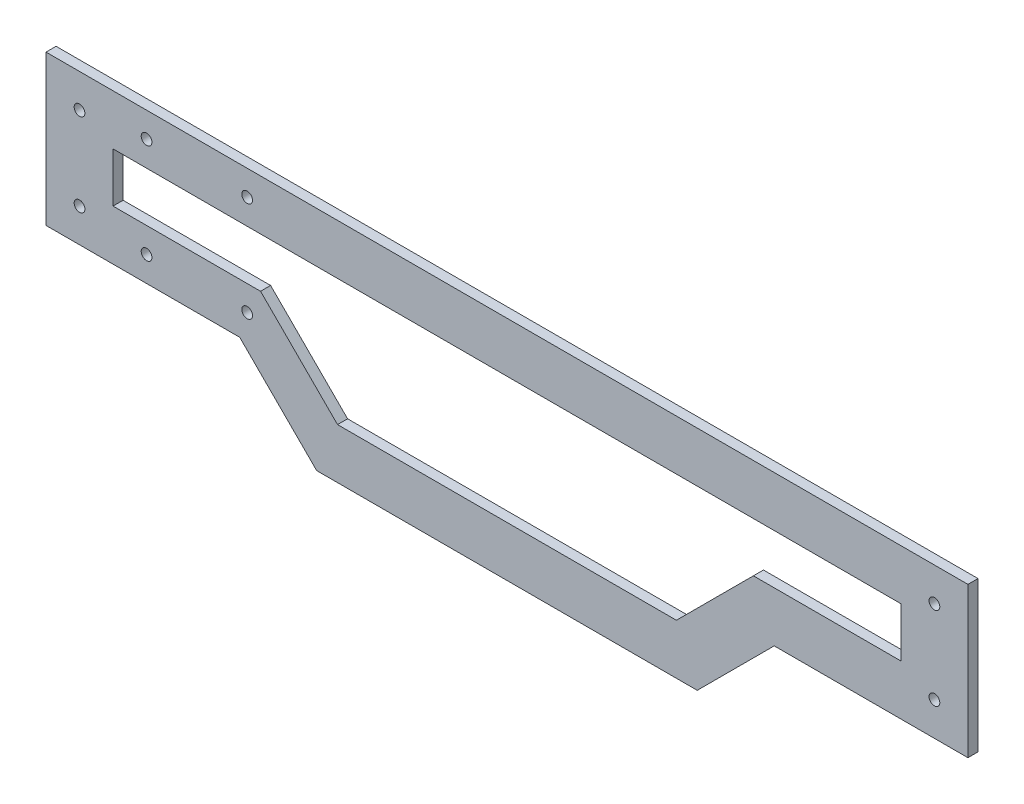
ISO-10303-21;
HEADER;
FILE_DESCRIPTION(('STEP AP214'),'2;1');
FILE_NAME('part.step','',(''),(''),'','','');
FILE_SCHEMA(('AUTOMOTIVE_DESIGN { 1 0 10303 214 1 1 1 1 }'));
ENDSEC;
DATA;
#1=APPLICATION_CONTEXT('core data for automotive mechanical design processes');
#2=APPLICATION_PROTOCOL_DEFINITION('international standard','automotive_design',2000,#1);
#3=PRODUCT_CONTEXT('',#1,'mechanical');
#4=PRODUCT('Part','Part','',(#3));
#5=PRODUCT_RELATED_PRODUCT_CATEGORY('part','',(#4));
#6=PRODUCT_DEFINITION_FORMATION('','',#4);
#7=PRODUCT_DEFINITION_CONTEXT('part definition',#1,'design');
#8=PRODUCT_DEFINITION('design','',#6,#7);
#9=PRODUCT_DEFINITION_SHAPE('','',#8);
#10=(LENGTH_UNIT() NAMED_UNIT(*) SI_UNIT(.MILLI.,.METRE.));
#11=(NAMED_UNIT(*) PLANE_ANGLE_UNIT() SI_UNIT($,.RADIAN.));
#12=(NAMED_UNIT(*) SI_UNIT($,.STERADIAN.) SOLID_ANGLE_UNIT());
#13=UNCERTAINTY_MEASURE_WITH_UNIT(LENGTH_MEASURE(1.E-05),#10,'distance_accuracy_value','');
#14=(GEOMETRIC_REPRESENTATION_CONTEXT(3) GLOBAL_UNCERTAINTY_ASSIGNED_CONTEXT((#13)) GLOBAL_UNIT_ASSIGNED_CONTEXT((#10,
#11,#12)) REPRESENTATION_CONTEXT('',''));
#15=CARTESIAN_POINT('',(0.,0.,0.));
#16=DIRECTION('',(0.,0.,1.));
#17=DIRECTION('',(1.,0.,0.));
#18=AXIS2_PLACEMENT_3D('',#15,#16,#17);
#19=CARTESIAN_POINT('',(0.,0.,3.));
#20=DIRECTION('',(0.,0.,-1.));
#21=DIRECTION('',(-1.,0.,0.));
#22=AXIS2_PLACEMENT_3D('',#19,#20,#21);
#23=PLANE('',#22);
#24=CARTESIAN_POINT('',(8.48992123506307,424.784503285472,3.));
#25=DIRECTION('',(0.,0.,-1.));
#26=DIRECTION('',(-1.,0.,0.));
#27=AXIS2_PLACEMENT_3D('',#24,#25,#26);
#28=CIRCLE('',#27,1.6);
#29=CARTESIAN_POINT('',(6.88992123506307,424.784503285472,3.));
#30=VERTEX_POINT('',#29);
#31=EDGE_CURVE('E408',#30,#30,#28,.T.);
#32=ORIENTED_EDGE('',*,*,#31,.T.);
#33=EDGE_LOOP('',(#32));
#34=FACE_BOUND('',#33,.T.);
#35=CARTESIAN_POINT('',(38.4899212350631,394.997048213572,3.));
#36=DIRECTION('',(0.,0.,-1.));
#37=DIRECTION('',(-1.,0.,0.));
#38=AXIS2_PLACEMENT_3D('',#35,#36,#37);
#39=CIRCLE('',#38,1.6);
#40=CARTESIAN_POINT('',(36.8899212350631,394.997048213572,3.));
#41=VERTEX_POINT('',#40);
#42=EDGE_CURVE('E404',#41,#41,#39,.T.);
#43=ORIENTED_EDGE('',*,*,#42,.T.);
#44=EDGE_LOOP('',(#43));
#45=FACE_BOUND('',#44,.T.);
#46=CARTESIAN_POINT('',(8.48992123506307,394.997048213572,3.));
#47=DIRECTION('',(0.,0.,-1.));
#48=DIRECTION('',(-1.,0.,0.));
#49=AXIS2_PLACEMENT_3D('',#46,#47,#48);
#50=CIRCLE('',#49,1.6);
#51=CARTESIAN_POINT('',(6.88992123506307,394.997048213572,3.));
#52=VERTEX_POINT('',#51);
#53=EDGE_CURVE('E402',#52,#52,#50,.T.);
#54=ORIENTED_EDGE('',*,*,#53,.T.);
#55=EDGE_LOOP('',(#54));
#56=FACE_BOUND('',#55,.T.);
#57=CARTESIAN_POINT('',(38.4899212350631,424.784503285472,3.));
#58=DIRECTION('',(0.,0.,-1.));
#59=DIRECTION('',(-1.,0.,0.));
#60=AXIS2_PLACEMENT_3D('',#57,#58,#59);
#61=CIRCLE('',#60,1.6);
#62=CARTESIAN_POINT('',(36.8899212350631,424.784503285472,3.));
#63=VERTEX_POINT('',#62);
#64=EDGE_CURVE('E405',#63,#63,#61,.T.);
#65=ORIENTED_EDGE('',*,*,#64,.T.);
#66=EDGE_LOOP('',(#65));
#67=FACE_BOUND('',#66,.T.);
#68=DIRECTION('',(0.,-1.,0.));
#69=VECTOR('',#68,1.);
#70=CARTESIAN_POINT('',(-21.5100787649369,387.497048213572,3.));
#71=LINE('',#70,#69);
#72=CARTESIAN_POINT('',(-21.5100787649369,432.284503285472,3.));
#73=VERTEX_POINT('',#72);
#74=CARTESIAN_POINT('',(-21.5100787649369,387.497048213572,3.));
#75=VERTEX_POINT('',#74);
#76=EDGE_CURVE('E216',#73,#75,#71,.T.);
#77=ORIENTED_EDGE('',*,*,#76,.T.);
#78=DIRECTION('',(1.,0.,0.));
#79=VECTOR('',#78,1.);
#80=CARTESIAN_POINT('',(36.2716671655838,387.497048213572,3.));
#81=LINE('',#80,#79);
#82=CARTESIAN_POINT('',(36.2716671655838,387.497048213572,3.));
#83=VERTEX_POINT('',#82);
#84=EDGE_CURVE('E219',#75,#83,#81,.T.);
#85=ORIENTED_EDGE('',*,*,#84,.T.);
#86=DIRECTION('',(0.707106781186548,-0.707106781186547,0.));
#87=VECTOR('',#86,1.);
#88=CARTESIAN_POINT('',(59.2342475847707,364.534467794385,3.));
#89=LINE('',#88,#87);
#90=CARTESIAN_POINT('',(59.2342475847707,364.534467794385,3.));
#91=VERTEX_POINT('',#90);
#92=EDGE_CURVE('E222',#83,#91,#89,.T.);
#93=ORIENTED_EDGE('',*,*,#92,.T.);
#94=DIRECTION('',(1.,0.,0.));
#95=VECTOR('',#94,1.);
#96=CARTESIAN_POINT('',(172.745594885355,364.534467794385,3.));
#97=LINE('',#96,#95);
#98=CARTESIAN_POINT('',(172.745594885355,364.534467794385,3.));
#99=VERTEX_POINT('',#98);
#100=EDGE_CURVE('E224',#91,#99,#97,.T.);
#101=ORIENTED_EDGE('',*,*,#100,.T.);
#102=DIRECTION('',(0.707106781186547,0.707106781186547,0.));
#103=VECTOR('',#102,1.);
#104=CARTESIAN_POINT('',(195.708175304542,387.497048213572,3.));
#105=LINE('',#104,#103);
#106=CARTESIAN_POINT('',(195.708175304542,387.497048213572,3.));
#107=VERTEX_POINT('',#106);
#108=EDGE_CURVE('E226',#99,#107,#105,.T.);
#109=ORIENTED_EDGE('',*,*,#108,.T.);
#110=DIRECTION('',(1.,0.,0.));
#111=VECTOR('',#110,1.);
#112=CARTESIAN_POINT('',(253.489921235063,387.497048213572,3.));
#113=LINE('',#112,#111);
#114=CARTESIAN_POINT('',(253.489921235063,387.497048213572,3.));
#115=VERTEX_POINT('',#114);
#116=EDGE_CURVE('E228',#107,#115,#113,.T.);
#117=ORIENTED_EDGE('',*,*,#116,.T.);
#118=DIRECTION('',(0.,1.,0.));
#119=VECTOR('',#118,1.);
#120=CARTESIAN_POINT('',(253.489921235063,432.284503285472,3.));
#121=LINE('',#120,#119);
#122=CARTESIAN_POINT('',(253.489921235063,432.284503285472,3.));
#123=VERTEX_POINT('',#122);
#124=EDGE_CURVE('E230',#115,#123,#121,.T.);
#125=ORIENTED_EDGE('',*,*,#124,.T.);
#126=DIRECTION('',(-1.,0.,0.));
#127=VECTOR('',#126,1.);
#128=CARTESIAN_POINT('',(-21.5100787649369,432.284503285472,3.));
#129=LINE('',#128,#127);
#130=EDGE_CURVE('E232',#123,#73,#129,.T.);
#131=ORIENTED_EDGE('',*,*,#130,.T.);
#132=EDGE_LOOP('',(#77,#85,#93,#101,#109,#117,#125,#131));
#133=FACE_BOUND('',#132,.T.);
#134=DIRECTION('',(0.,-1.,0.));
#135=VECTOR('',#134,1.);
#136=CARTESIAN_POINT('',(-1.51007876493693,402.497048213572,3.));
#137=LINE('',#136,#135);
#138=CARTESIAN_POINT('',(-1.51007876493693,417.284503285472,3.));
#139=VERTEX_POINT('',#138);
#140=CARTESIAN_POINT('',(-1.51007876493693,402.497048213572,3.));
#141=VERTEX_POINT('',#140);
#142=EDGE_CURVE('E148',#139,#141,#137,.T.);
#143=ORIENTED_EDGE('',*,*,#142,.F.);
#144=DIRECTION('',(-1.,0.,0.));
#145=VECTOR('',#144,1.);
#146=CARTESIAN_POINT('',(-1.51007876493693,417.284503285472,3.));
#147=LINE('',#146,#145);
#148=CARTESIAN_POINT('',(233.489921235063,417.284503285472,3.));
#149=VERTEX_POINT('',#148);
#150=EDGE_CURVE('E183',#149,#139,#147,.T.);
#151=ORIENTED_EDGE('',*,*,#150,.F.);
#152=DIRECTION('',(0.,1.,0.));
#153=VECTOR('',#152,1.);
#154=CARTESIAN_POINT('',(233.489921235063,417.284503285472,3.));
#155=LINE('',#154,#153);
#156=CARTESIAN_POINT('',(233.489921235063,402.497048213572,3.));
#157=VERTEX_POINT('',#156);
#158=EDGE_CURVE('E181',#157,#149,#155,.T.);
#159=ORIENTED_EDGE('',*,*,#158,.F.);
#160=DIRECTION('',(1.,0.,0.));
#161=VECTOR('',#160,1.);
#162=CARTESIAN_POINT('',(233.489921235063,402.497048213572,3.));
#163=LINE('',#162,#161);
#164=CARTESIAN_POINT('',(189.494971868946,402.497048213572,3.));
#165=VERTEX_POINT('',#164);
#166=EDGE_CURVE('E179',#165,#157,#163,.T.);
#167=ORIENTED_EDGE('',*,*,#166,.F.);
#168=DIRECTION('',(0.707106781186547,0.707106781186548,0.));
#169=VECTOR('',#168,1.);
#170=CARTESIAN_POINT('',(189.494971868946,402.497048213572,3.));
#171=LINE('',#170,#169);
#172=CARTESIAN_POINT('',(166.532391449759,379.534467794385,3.));
#173=VERTEX_POINT('',#172);
#174=EDGE_CURVE('E177',#173,#165,#171,.T.);
#175=ORIENTED_EDGE('',*,*,#174,.F.);
#176=DIRECTION('',(1.,0.,0.));
#177=VECTOR('',#176,1.);
#178=CARTESIAN_POINT('',(166.532391449759,379.534467794385,3.));
#179=LINE('',#178,#177);
#180=CARTESIAN_POINT('',(65.4474510203671,379.534467794385,3.));
#181=VERTEX_POINT('',#180);
#182=EDGE_CURVE('E172',#181,#173,#179,.T.);
#183=ORIENTED_EDGE('',*,*,#182,.F.);
#184=DIRECTION('',(0.707106781186548,-0.707106781186547,0.));
#185=VECTOR('',#184,1.);
#186=CARTESIAN_POINT('',(65.4474510203671,379.534467794385,3.));
#187=LINE('',#186,#185);
#188=CARTESIAN_POINT('',(42.4848706011802,402.497048213572,3.));
#189=VERTEX_POINT('',#188);
#190=EDGE_CURVE('E170',#189,#181,#187,.T.);
#191=ORIENTED_EDGE('',*,*,#190,.F.);
#192=DIRECTION('',(1.,0.,0.));
#193=VECTOR('',#192,1.);
#194=CARTESIAN_POINT('',(42.4848706011802,402.497048213572,3.));
#195=LINE('',#194,#193);
#196=EDGE_CURVE('E156',#141,#189,#195,.T.);
#197=ORIENTED_EDGE('',*,*,#196,.F.);
#198=EDGE_LOOP('',(#143,#151,#159,#167,#175,#183,#191,#197));
#199=FACE_BOUND('',#198,.T.);
#200=CARTESIAN_POINT('',(-11.5100787649369,422.284503285472,3.));
#201=DIRECTION('',(0.,0.,1.));
#202=DIRECTION('',(1.,0.,0.));
#203=AXIS2_PLACEMENT_3D('',#200,#201,#202);
#204=CIRCLE('',#203,1.6);
#205=CARTESIAN_POINT('',(-9.91007876493693,422.284503285472,3.));
#206=VERTEX_POINT('',#205);
#207=EDGE_CURVE('E186',#206,#206,#204,.T.);
#208=ORIENTED_EDGE('',*,*,#207,.F.);
#209=EDGE_LOOP('',(#208));
#210=FACE_BOUND('',#209,.T.);
#211=CARTESIAN_POINT('',(-11.5100787649369,397.497048213572,3.));
#212=DIRECTION('',(0.,0.,1.));
#213=DIRECTION('',(1.,0.,0.));
#214=AXIS2_PLACEMENT_3D('',#211,#212,#213);
#215=CIRCLE('',#214,1.6);
#216=CARTESIAN_POINT('',(-9.91007876493693,397.497048213572,3.));
#217=VERTEX_POINT('',#216);
#218=EDGE_CURVE('E429',#217,#217,#215,.T.);
#219=ORIENTED_EDGE('',*,*,#218,.F.);
#220=EDGE_LOOP('',(#219));
#221=FACE_BOUND('',#220,.T.);
#222=CARTESIAN_POINT('',(243.489921235063,397.497048213572,3.));
#223=DIRECTION('',(0.,0.,1.));
#224=DIRECTION('',(-1.,0.,0.));
#225=AXIS2_PLACEMENT_3D('',#222,#223,#224);
#226=CIRCLE('',#225,1.59999999999999);
#227=CARTESIAN_POINT('',(241.889921235063,397.497048213572,3.));
#228=VERTEX_POINT('',#227);
#229=EDGE_CURVE('E423',#228,#228,#226,.T.);
#230=ORIENTED_EDGE('',*,*,#229,.F.);
#231=EDGE_LOOP('',(#230));
#232=FACE_BOUND('',#231,.T.);
#233=CARTESIAN_POINT('',(243.489921235063,422.284503285471,3.));
#234=DIRECTION('',(0.,0.,1.));
#235=DIRECTION('',(-1.,0.,0.));
#236=AXIS2_PLACEMENT_3D('',#233,#234,#235);
#237=CIRCLE('',#236,1.59999999999999);
#238=CARTESIAN_POINT('',(241.889921235063,422.284503285471,3.));
#239=VERTEX_POINT('',#238);
#240=EDGE_CURVE('E417',#239,#239,#237,.T.);
#241=ORIENTED_EDGE('',*,*,#240,.F.);
#242=EDGE_LOOP('',(#241));
#243=FACE_BOUND('',#242,.T.);
#244=ADVANCED_FACE('F35',(#34,#45,#56,#67,#133,#199,#210,#221,#232,#243),#23,.F.);
#245=CARTESIAN_POINT('',(0.,0.,0.));
#246=DIRECTION('',(0.,0.,-1.));
#247=DIRECTION('',(-1.,0.,0.));
#248=AXIS2_PLACEMENT_3D('',#245,#246,#247);
#249=PLANE('',#248);
#250=CARTESIAN_POINT('',(8.48992123506307,424.784503285472,0.));
#251=DIRECTION('',(0.,0.,-1.));
#252=DIRECTION('',(-1.,0.,0.));
#253=AXIS2_PLACEMENT_3D('',#250,#251,#252);
#254=CIRCLE('',#253,1.6);
#255=CARTESIAN_POINT('',(6.88992123506307,424.784503285472,0.));
#256=VERTEX_POINT('',#255);
#257=EDGE_CURVE('E460',#256,#256,#254,.T.);
#258=ORIENTED_EDGE('',*,*,#257,.F.);
#259=EDGE_LOOP('',(#258));
#260=FACE_BOUND('',#259,.T.);
#261=CARTESIAN_POINT('',(38.4899212350631,394.997048213572,0.));
#262=DIRECTION('',(0.,0.,-1.));
#263=DIRECTION('',(-1.,0.,0.));
#264=AXIS2_PLACEMENT_3D('',#261,#262,#263);
#265=CIRCLE('',#264,1.6);
#266=CARTESIAN_POINT('',(36.8899212350631,394.997048213572,0.));
#267=VERTEX_POINT('',#266);
#268=EDGE_CURVE('E461',#267,#267,#265,.T.);
#269=ORIENTED_EDGE('',*,*,#268,.F.);
#270=EDGE_LOOP('',(#269));
#271=FACE_BOUND('',#270,.T.);
#272=CARTESIAN_POINT('',(8.48992123506307,394.997048213572,0.));
#273=DIRECTION('',(0.,0.,-1.));
#274=DIRECTION('',(-1.,0.,0.));
#275=AXIS2_PLACEMENT_3D('',#272,#273,#274);
#276=CIRCLE('',#275,1.6);
#277=CARTESIAN_POINT('',(6.88992123506307,394.997048213572,0.));
#278=VERTEX_POINT('',#277);
#279=EDGE_CURVE('E399',#278,#278,#276,.T.);
#280=ORIENTED_EDGE('',*,*,#279,.F.);
#281=EDGE_LOOP('',(#280));
#282=FACE_BOUND('',#281,.T.);
#283=CARTESIAN_POINT('',(38.4899212350631,424.784503285472,0.));
#284=DIRECTION('',(0.,0.,-1.));
#285=DIRECTION('',(-1.,0.,0.));
#286=AXIS2_PLACEMENT_3D('',#283,#284,#285);
#287=CIRCLE('',#286,1.6);
#288=CARTESIAN_POINT('',(36.8899212350631,424.784503285472,0.));
#289=VERTEX_POINT('',#288);
#290=EDGE_CURVE('E411',#289,#289,#287,.T.);
#291=ORIENTED_EDGE('',*,*,#290,.F.);
#292=EDGE_LOOP('',(#291));
#293=FACE_BOUND('',#292,.T.);
#294=CARTESIAN_POINT('',(243.489921235063,397.497048213572,0.));
#295=DIRECTION('',(0.,0.,1.));
#296=DIRECTION('',(-1.,0.,0.));
#297=AXIS2_PLACEMENT_3D('',#294,#295,#296);
#298=CIRCLE('',#297,1.59999999999999);
#299=CARTESIAN_POINT('',(241.889921235063,397.497048213572,0.));
#300=VERTEX_POINT('',#299);
#301=EDGE_CURVE('E420',#300,#300,#298,.T.);
#302=ORIENTED_EDGE('',*,*,#301,.T.);
#303=EDGE_LOOP('',(#302));
#304=FACE_BOUND('',#303,.T.);
#305=CARTESIAN_POINT('',(-11.5100787649369,422.284503285472,0.));
#306=DIRECTION('',(0.,0.,1.));
#307=DIRECTION('',(1.,0.,0.));
#308=AXIS2_PLACEMENT_3D('',#305,#306,#307);
#309=CIRCLE('',#308,1.6);
#310=CARTESIAN_POINT('',(-9.91007876493693,422.284503285472,0.));
#311=VERTEX_POINT('',#310);
#312=EDGE_CURVE('E432',#311,#311,#309,.T.);
#313=ORIENTED_EDGE('',*,*,#312,.T.);
#314=EDGE_LOOP('',(#313));
#315=FACE_BOUND('',#314,.T.);
#316=DIRECTION('',(0.,-1.,0.));
#317=VECTOR('',#316,1.);
#318=CARTESIAN_POINT('',(-21.5100787649369,387.497048213572,0.));
#319=LINE('',#318,#317);
#320=CARTESIAN_POINT('',(-21.5100787649369,432.284503285472,0.));
#321=VERTEX_POINT('',#320);
#322=CARTESIAN_POINT('',(-21.5100787649369,387.497048213572,0.));
#323=VERTEX_POINT('',#322);
#324=EDGE_CURVE('E164',#321,#323,#319,.T.);
#325=ORIENTED_EDGE('',*,*,#324,.F.);
#326=DIRECTION('',(-1.,0.,0.));
#327=VECTOR('',#326,1.);
#328=CARTESIAN_POINT('',(-21.5100787649369,432.284503285472,0.));
#329=LINE('',#328,#327);
#330=CARTESIAN_POINT('',(253.489921235063,432.284503285472,0.));
#331=VERTEX_POINT('',#330);
#332=EDGE_CURVE('E220',#331,#321,#329,.T.);
#333=ORIENTED_EDGE('',*,*,#332,.F.);
#334=DIRECTION('',(0.,1.,0.));
#335=VECTOR('',#334,1.);
#336=CARTESIAN_POINT('',(253.489921235063,432.284503285472,0.));
#337=LINE('',#336,#335);
#338=CARTESIAN_POINT('',(253.489921235063,387.497048213572,0.));
#339=VERTEX_POINT('',#338);
#340=EDGE_CURVE('E247',#339,#331,#337,.T.);
#341=ORIENTED_EDGE('',*,*,#340,.F.);
#342=DIRECTION('',(1.,0.,0.));
#343=VECTOR('',#342,1.);
#344=CARTESIAN_POINT('',(253.489921235063,387.497048213572,0.));
#345=LINE('',#344,#343);
#346=CARTESIAN_POINT('',(195.708175304542,387.497048213572,0.));
#347=VERTEX_POINT('',#346);
#348=EDGE_CURVE('E245',#347,#339,#345,.T.);
#349=ORIENTED_EDGE('',*,*,#348,.F.);
#350=DIRECTION('',(0.707106781186547,0.707106781186547,0.));
#351=VECTOR('',#350,1.);
#352=CARTESIAN_POINT('',(195.708175304542,387.497048213572,0.));
#353=LINE('',#352,#351);
#354=CARTESIAN_POINT('',(172.745594885355,364.534467794385,0.));
#355=VERTEX_POINT('',#354);
#356=EDGE_CURVE('E243',#355,#347,#353,.T.);
#357=ORIENTED_EDGE('',*,*,#356,.F.);
#358=DIRECTION('',(1.,0.,0.));
#359=VECTOR('',#358,1.);
#360=CARTESIAN_POINT('',(172.745594885355,364.534467794385,0.));
#361=LINE('',#360,#359);
#362=CARTESIAN_POINT('',(59.2342475847707,364.534467794385,0.));
#363=VERTEX_POINT('',#362);
#364=EDGE_CURVE('E241',#363,#355,#361,.T.);
#365=ORIENTED_EDGE('',*,*,#364,.F.);
#366=DIRECTION('',(0.707106781186548,-0.707106781186547,0.));
#367=VECTOR('',#366,1.);
#368=CARTESIAN_POINT('',(59.2342475847707,364.534467794385,0.));
#369=LINE('',#368,#367);
#370=CARTESIAN_POINT('',(36.2716671655838,387.497048213572,0.));
#371=VERTEX_POINT('',#370);
#372=EDGE_CURVE('E239',#371,#363,#369,.T.);
#373=ORIENTED_EDGE('',*,*,#372,.F.);
#374=DIRECTION('',(1.,0.,0.));
#375=VECTOR('',#374,1.);
#376=CARTESIAN_POINT('',(36.2716671655838,387.497048213572,0.));
#377=LINE('',#376,#375);
#378=EDGE_CURVE('E237',#323,#371,#377,.T.);
#379=ORIENTED_EDGE('',*,*,#378,.F.);
#380=EDGE_LOOP('',(#325,#333,#341,#349,#357,#365,#373,#379));
#381=FACE_BOUND('',#380,.T.);
#382=DIRECTION('',(-1.,0.,0.));
#383=VECTOR('',#382,1.);
#384=CARTESIAN_POINT('',(-1.51007876493693,417.284503285472,0.));
#385=LINE('',#384,#383);
#386=CARTESIAN_POINT('',(233.489921235063,417.284503285472,0.));
#387=VERTEX_POINT('',#386);
#388=CARTESIAN_POINT('',(-1.51007876493693,417.284503285472,0.));
#389=VERTEX_POINT('',#388);
#390=EDGE_CURVE('E157',#387,#389,#385,.T.);
#391=ORIENTED_EDGE('',*,*,#390,.T.);
#392=DIRECTION('',(0.,-1.,0.));
#393=VECTOR('',#392,1.);
#394=CARTESIAN_POINT('',(-1.51007876493693,402.497048213572,0.));
#395=LINE('',#394,#393);
#396=CARTESIAN_POINT('',(-1.51007876493693,402.497048213572,0.));
#397=VERTEX_POINT('',#396);
#398=EDGE_CURVE('E58',#389,#397,#395,.T.);
#399=ORIENTED_EDGE('',*,*,#398,.T.);
#400=DIRECTION('',(1.,0.,0.));
#401=VECTOR('',#400,1.);
#402=CARTESIAN_POINT('',(42.4848706011802,402.497048213572,0.));
#403=LINE('',#402,#401);
#404=CARTESIAN_POINT('',(42.4848706011802,402.497048213572,0.));
#405=VERTEX_POINT('',#404);
#406=EDGE_CURVE('E163',#397,#405,#403,.T.);
#407=ORIENTED_EDGE('',*,*,#406,.T.);
#408=DIRECTION('',(0.707106781186548,-0.707106781186547,0.));
#409=VECTOR('',#408,1.);
#410=CARTESIAN_POINT('',(65.4474510203671,379.534467794385,0.));
#411=LINE('',#410,#409);
#412=CARTESIAN_POINT('',(65.4474510203671,379.534467794385,0.));
#413=VERTEX_POINT('',#412);
#414=EDGE_CURVE('E188',#405,#413,#411,.T.);
#415=ORIENTED_EDGE('',*,*,#414,.T.);
#416=DIRECTION('',(1.,0.,0.));
#417=VECTOR('',#416,1.);
#418=CARTESIAN_POINT('',(166.532391449759,379.534467794385,0.));
#419=LINE('',#418,#417);
#420=CARTESIAN_POINT('',(166.532391449759,379.534467794385,0.));
#421=VERTEX_POINT('',#420);
#422=EDGE_CURVE('E191',#413,#421,#419,.T.);
#423=ORIENTED_EDGE('',*,*,#422,.T.);
#424=DIRECTION('',(0.707106781186547,0.707106781186548,0.));
#425=VECTOR('',#424,1.);
#426=CARTESIAN_POINT('',(189.494971868946,402.497048213572,0.));
#427=LINE('',#426,#425);
#428=CARTESIAN_POINT('',(189.494971868946,402.497048213572,0.));
#429=VERTEX_POINT('',#428);
#430=EDGE_CURVE('E194',#421,#429,#427,.T.);
#431=ORIENTED_EDGE('',*,*,#430,.T.);
#432=DIRECTION('',(1.,0.,0.));
#433=VECTOR('',#432,1.);
#434=CARTESIAN_POINT('',(233.489921235063,402.497048213572,0.));
#435=LINE('',#434,#433);
#436=CARTESIAN_POINT('',(233.489921235063,402.497048213572,0.));
#437=VERTEX_POINT('',#436);
#438=EDGE_CURVE('E197',#429,#437,#435,.T.);
#439=ORIENTED_EDGE('',*,*,#438,.T.);
#440=DIRECTION('',(0.,1.,0.));
#441=VECTOR('',#440,1.);
#442=CARTESIAN_POINT('',(233.489921235063,417.284503285472,0.));
#443=LINE('',#442,#441);
#444=EDGE_CURVE('E200',#437,#387,#443,.T.);
#445=ORIENTED_EDGE('',*,*,#444,.T.);
#446=EDGE_LOOP('',(#391,#399,#407,#415,#423,#431,#439,#445));
#447=FACE_BOUND('',#446,.T.);
#448=CARTESIAN_POINT('',(-11.5100787649369,397.497048213572,0.));
#449=DIRECTION('',(0.,0.,1.));
#450=DIRECTION('',(1.,0.,0.));
#451=AXIS2_PLACEMENT_3D('',#448,#449,#450);
#452=CIRCLE('',#451,1.6);
#453=CARTESIAN_POINT('',(-9.91007876493693,397.497048213572,0.));
#454=VERTEX_POINT('',#453);
#455=EDGE_CURVE('E426',#454,#454,#452,.T.);
#456=ORIENTED_EDGE('',*,*,#455,.T.);
#457=EDGE_LOOP('',(#456));
#458=FACE_BOUND('',#457,.T.);
#459=CARTESIAN_POINT('',(243.489921235063,422.284503285471,0.));
#460=DIRECTION('',(0.,0.,1.));
#461=DIRECTION('',(-1.,0.,0.));
#462=AXIS2_PLACEMENT_3D('',#459,#460,#461);
#463=CIRCLE('',#462,1.59999999999999);
#464=CARTESIAN_POINT('',(241.889921235063,422.284503285471,0.));
#465=VERTEX_POINT('',#464);
#466=EDGE_CURVE('E416',#465,#465,#463,.T.);
#467=ORIENTED_EDGE('',*,*,#466,.T.);
#468=EDGE_LOOP('',(#467));
#469=FACE_BOUND('',#468,.T.);
#470=ADVANCED_FACE('F277',(#260,#271,#282,#293,#304,#315,#381,#447,#458,#469),#249,.T.);
#471=CARTESIAN_POINT('',(-21.5100787649369,387.497048213572,3.));
#472=DIRECTION('',(1.,0.,0.));
#473=DIRECTION('',(0.,0.,-1.));
#474=AXIS2_PLACEMENT_3D('',#471,#472,#473);
#475=PLANE('',#474);
#476=ORIENTED_EDGE('',*,*,#324,.T.);
#477=DIRECTION('',(0.,0.,-1.));
#478=VECTOR('',#477,1.);
#479=CARTESIAN_POINT('',(-21.5100787649369,387.497048213572,3.));
#480=LINE('',#479,#478);
#481=EDGE_CURVE('E11',#75,#323,#480,.T.);
#482=ORIENTED_EDGE('',*,*,#481,.F.);
#483=ORIENTED_EDGE('',*,*,#76,.F.);
#484=DIRECTION('',(0.,0.,-1.));
#485=VECTOR('',#484,1.);
#486=CARTESIAN_POINT('',(-21.5100787649369,432.284503285472,3.));
#487=LINE('',#486,#485);
#488=EDGE_CURVE('E234',#73,#321,#487,.T.);
#489=ORIENTED_EDGE('',*,*,#488,.T.);
#490=EDGE_LOOP('',(#476,#482,#483,#489));
#491=FACE_BOUND('',#490,.T.);
#492=ADVANCED_FACE('F37',(#491),#475,.F.);
#493=CARTESIAN_POINT('',(36.2716671655838,387.497048213572,3.));
#494=DIRECTION('',(0.,1.,0.));
#495=DIRECTION('',(0.,0.,1.));
#496=AXIS2_PLACEMENT_3D('',#493,#494,#495);
#497=PLANE('',#496);
#498=ORIENTED_EDGE('',*,*,#378,.T.);
#499=DIRECTION('',(0.,0.,-1.));
#500=VECTOR('',#499,1.);
#501=CARTESIAN_POINT('',(36.2716671655838,387.497048213572,3.));
#502=LINE('',#501,#500);
#503=EDGE_CURVE('E43',#83,#371,#502,.T.);
#504=ORIENTED_EDGE('',*,*,#503,.F.);
#505=ORIENTED_EDGE('',*,*,#84,.F.);
#506=ORIENTED_EDGE('',*,*,#481,.T.);
#507=EDGE_LOOP('',(#498,#504,#505,#506));
#508=FACE_BOUND('',#507,.T.);
#509=ADVANCED_FACE('F294',(#508),#497,.F.);
#510=CARTESIAN_POINT('',(59.2342475847707,364.534467794385,3.));
#511=DIRECTION('',(0.707106781186547,0.707106781186548,0.));
#512=DIRECTION('',(-0.707106781186548,0.707106781186547,0.));
#513=AXIS2_PLACEMENT_3D('',#510,#511,#512);
#514=PLANE('',#513);
#515=ORIENTED_EDGE('',*,*,#372,.T.);
#516=DIRECTION('',(0.,0.,-1.));
#517=VECTOR('',#516,1.);
#518=CARTESIAN_POINT('',(59.2342475847707,364.534467794385,3.));
#519=LINE('',#518,#517);
#520=EDGE_CURVE('E264',#91,#363,#519,.T.);
#521=ORIENTED_EDGE('',*,*,#520,.F.);
#522=ORIENTED_EDGE('',*,*,#92,.F.);
#523=ORIENTED_EDGE('',*,*,#503,.T.);
#524=EDGE_LOOP('',(#515,#521,#522,#523));
#525=FACE_BOUND('',#524,.T.);
#526=ADVANCED_FACE('F271',(#525),#514,.F.);
#527=CARTESIAN_POINT('',(172.745594885355,364.534467794385,3.));
#528=DIRECTION('',(0.,1.,0.));
#529=DIRECTION('',(0.,0.,1.));
#530=AXIS2_PLACEMENT_3D('',#527,#528,#529);
#531=PLANE('',#530);
#532=ORIENTED_EDGE('',*,*,#364,.T.);
#533=DIRECTION('',(0.,0.,-1.));
#534=VECTOR('',#533,1.);
#535=CARTESIAN_POINT('',(172.745594885355,364.534467794385,3.));
#536=LINE('',#535,#534);
#537=EDGE_CURVE('E261',#99,#355,#536,.T.);
#538=ORIENTED_EDGE('',*,*,#537,.F.);
#539=ORIENTED_EDGE('',*,*,#100,.F.);
#540=ORIENTED_EDGE('',*,*,#520,.T.);
#541=EDGE_LOOP('',(#532,#538,#539,#540));
#542=FACE_BOUND('',#541,.T.);
#543=ADVANCED_FACE('F283',(#542),#531,.F.);
#544=CARTESIAN_POINT('',(195.708175304542,387.497048213572,3.));
#545=DIRECTION('',(-0.707106781186548,0.707106781186548,0.));
#546=DIRECTION('',(-0.707106781186548,-0.707106781186548,0.));
#547=AXIS2_PLACEMENT_3D('',#544,#545,#546);
#548=PLANE('',#547);
#549=ORIENTED_EDGE('',*,*,#356,.T.);
#550=DIRECTION('',(0.,0.,-1.));
#551=VECTOR('',#550,1.);
#552=CARTESIAN_POINT('',(195.708175304542,387.497048213572,3.));
#553=LINE('',#552,#551);
#554=EDGE_CURVE('E258',#107,#347,#553,.T.);
#555=ORIENTED_EDGE('',*,*,#554,.F.);
#556=ORIENTED_EDGE('',*,*,#108,.F.);
#557=ORIENTED_EDGE('',*,*,#537,.T.);
#558=EDGE_LOOP('',(#549,#555,#556,#557));
#559=FACE_BOUND('',#558,.T.);
#560=ADVANCED_FACE('F287',(#559),#548,.F.);
#561=CARTESIAN_POINT('',(253.489921235063,387.497048213572,3.));
#562=DIRECTION('',(0.,1.,0.));
#563=DIRECTION('',(0.,0.,1.));
#564=AXIS2_PLACEMENT_3D('',#561,#562,#563);
#565=PLANE('',#564);
#566=ORIENTED_EDGE('',*,*,#348,.T.);
#567=DIRECTION('',(0.,0.,-1.));
#568=VECTOR('',#567,1.);
#569=CARTESIAN_POINT('',(253.489921235063,387.497048213572,3.));
#570=LINE('',#569,#568);
#571=EDGE_CURVE('E255',#115,#339,#570,.T.);
#572=ORIENTED_EDGE('',*,*,#571,.F.);
#573=ORIENTED_EDGE('',*,*,#116,.F.);
#574=ORIENTED_EDGE('',*,*,#554,.T.);
#575=EDGE_LOOP('',(#566,#572,#573,#574));
#576=FACE_BOUND('',#575,.T.);
#577=ADVANCED_FACE('F307',(#576),#565,.F.);
#578=CARTESIAN_POINT('',(253.489921235063,432.284503285472,3.));
#579=DIRECTION('',(-1.,0.,0.));
#580=DIRECTION('',(0.,0.,1.));
#581=AXIS2_PLACEMENT_3D('',#578,#579,#580);
#582=PLANE('',#581);
#583=ORIENTED_EDGE('',*,*,#340,.T.);
#584=DIRECTION('',(0.,0.,-1.));
#585=VECTOR('',#584,1.);
#586=CARTESIAN_POINT('',(253.489921235063,432.284503285472,3.));
#587=LINE('',#586,#585);
#588=EDGE_CURVE('E252',#123,#331,#587,.T.);
#589=ORIENTED_EDGE('',*,*,#588,.F.);
#590=ORIENTED_EDGE('',*,*,#124,.F.);
#591=ORIENTED_EDGE('',*,*,#571,.T.);
#592=EDGE_LOOP('',(#583,#589,#590,#591));
#593=FACE_BOUND('',#592,.T.);
#594=ADVANCED_FACE('F305',(#593),#582,.F.);
#595=CARTESIAN_POINT('',(-21.5100787649369,432.284503285472,3.));
#596=DIRECTION('',(0.,-1.,0.));
#597=DIRECTION('',(0.,0.,-1.));
#598=AXIS2_PLACEMENT_3D('',#595,#596,#597);
#599=PLANE('',#598);
#600=ORIENTED_EDGE('',*,*,#332,.T.);
#601=ORIENTED_EDGE('',*,*,#488,.F.);
#602=ORIENTED_EDGE('',*,*,#130,.F.);
#603=ORIENTED_EDGE('',*,*,#588,.T.);
#604=EDGE_LOOP('',(#600,#601,#602,#603));
#605=FACE_BOUND('',#604,.T.);
#606=ADVANCED_FACE('F300',(#605),#599,.F.);
#607=CARTESIAN_POINT('',(-1.51007876493693,402.497048213572,3.));
#608=DIRECTION('',(1.,0.,0.));
#609=DIRECTION('',(0.,0.,-1.));
#610=AXIS2_PLACEMENT_3D('',#607,#608,#609);
#611=PLANE('',#610);
#612=ORIENTED_EDGE('',*,*,#398,.F.);
#613=DIRECTION('',(0.,0.,-1.));
#614=VECTOR('',#613,1.);
#615=CARTESIAN_POINT('',(-1.51007876493693,417.284503285472,3.));
#616=LINE('',#615,#614);
#617=EDGE_CURVE('E152',#139,#389,#616,.T.);
#618=ORIENTED_EDGE('',*,*,#617,.F.);
#619=ORIENTED_EDGE('',*,*,#142,.T.);
#620=DIRECTION('',(0.,0.,-1.));
#621=VECTOR('',#620,1.);
#622=CARTESIAN_POINT('',(-1.51007876493693,402.497048213572,3.));
#623=LINE('',#622,#621);
#624=EDGE_CURVE('E151',#141,#397,#623,.T.);
#625=ORIENTED_EDGE('',*,*,#624,.T.);
#626=EDGE_LOOP('',(#612,#618,#619,#625));
#627=FACE_BOUND('',#626,.T.);
#628=ADVANCED_FACE('F150',(#627),#611,.T.);
#629=CARTESIAN_POINT('',(42.4848706011802,402.497048213572,3.));
#630=DIRECTION('',(0.,1.,0.));
#631=DIRECTION('',(0.,0.,1.));
#632=AXIS2_PLACEMENT_3D('',#629,#630,#631);
#633=PLANE('',#632);
#634=ORIENTED_EDGE('',*,*,#406,.F.);
#635=ORIENTED_EDGE('',*,*,#624,.F.);
#636=ORIENTED_EDGE('',*,*,#196,.T.);
#637=DIRECTION('',(0.,0.,-1.));
#638=VECTOR('',#637,1.);
#639=CARTESIAN_POINT('',(42.4848706011802,402.497048213572,3.));
#640=LINE('',#639,#638);
#641=EDGE_CURVE('E165',#189,#405,#640,.T.);
#642=ORIENTED_EDGE('',*,*,#641,.T.);
#643=EDGE_LOOP('',(#634,#635,#636,#642));
#644=FACE_BOUND('',#643,.T.);
#645=ADVANCED_FACE('F160',(#644),#633,.T.);
#646=CARTESIAN_POINT('',(65.4474510203671,379.534467794385,3.));
#647=DIRECTION('',(0.707106781186547,0.707106781186548,0.));
#648=DIRECTION('',(-0.707106781186548,0.707106781186547,0.));
#649=AXIS2_PLACEMENT_3D('',#646,#647,#648);
#650=PLANE('',#649);
#651=ORIENTED_EDGE('',*,*,#414,.F.);
#652=ORIENTED_EDGE('',*,*,#641,.F.);
#653=ORIENTED_EDGE('',*,*,#190,.T.);
#654=DIRECTION('',(0.,0.,-1.));
#655=VECTOR('',#654,1.);
#656=CARTESIAN_POINT('',(65.4474510203671,379.534467794385,3.));
#657=LINE('',#656,#655);
#658=EDGE_CURVE('E213',#181,#413,#657,.T.);
#659=ORIENTED_EDGE('',*,*,#658,.T.);
#660=EDGE_LOOP('',(#651,#652,#653,#659));
#661=FACE_BOUND('',#660,.T.);
#662=ADVANCED_FACE('F337',(#661),#650,.T.);
#663=CARTESIAN_POINT('',(166.532391449759,379.534467794385,3.));
#664=DIRECTION('',(0.,1.,0.));
#665=DIRECTION('',(0.,0.,1.));
#666=AXIS2_PLACEMENT_3D('',#663,#664,#665);
#667=PLANE('',#666);
#668=ORIENTED_EDGE('',*,*,#422,.F.);
#669=ORIENTED_EDGE('',*,*,#658,.F.);
#670=ORIENTED_EDGE('',*,*,#182,.T.);
#671=DIRECTION('',(0.,0.,-1.));
#672=VECTOR('',#671,1.);
#673=CARTESIAN_POINT('',(166.532391449759,379.534467794385,3.));
#674=LINE('',#673,#672);
#675=EDGE_CURVE('E211',#173,#421,#674,.T.);
#676=ORIENTED_EDGE('',*,*,#675,.T.);
#677=EDGE_LOOP('',(#668,#669,#670,#676));
#678=FACE_BOUND('',#677,.T.);
#679=ADVANCED_FACE('F341',(#678),#667,.T.);
#680=CARTESIAN_POINT('',(189.494971868946,402.497048213572,3.));
#681=DIRECTION('',(-0.707106781186548,0.707106781186547,0.));
#682=DIRECTION('',(-0.707106781186547,-0.707106781186548,0.));
#683=AXIS2_PLACEMENT_3D('',#680,#681,#682);
#684=PLANE('',#683);
#685=ORIENTED_EDGE('',*,*,#430,.F.);
#686=ORIENTED_EDGE('',*,*,#675,.F.);
#687=ORIENTED_EDGE('',*,*,#174,.T.);
#688=DIRECTION('',(0.,0.,-1.));
#689=VECTOR('',#688,1.);
#690=CARTESIAN_POINT('',(189.494971868946,402.497048213572,3.));
#691=LINE('',#690,#689);
#692=EDGE_CURVE('E209',#165,#429,#691,.T.);
#693=ORIENTED_EDGE('',*,*,#692,.T.);
#694=EDGE_LOOP('',(#685,#686,#687,#693));
#695=FACE_BOUND('',#694,.T.);
#696=ADVANCED_FACE('F347',(#695),#684,.T.);
#697=CARTESIAN_POINT('',(233.489921235063,402.497048213572,3.));
#698=DIRECTION('',(0.,1.,0.));
#699=DIRECTION('',(0.,0.,1.));
#700=AXIS2_PLACEMENT_3D('',#697,#698,#699);
#701=PLANE('',#700);
#702=ORIENTED_EDGE('',*,*,#438,.F.);
#703=ORIENTED_EDGE('',*,*,#692,.F.);
#704=ORIENTED_EDGE('',*,*,#166,.T.);
#705=DIRECTION('',(0.,0.,-1.));
#706=VECTOR('',#705,1.);
#707=CARTESIAN_POINT('',(233.489921235063,402.497048213572,3.));
#708=LINE('',#707,#706);
#709=EDGE_CURVE('E207',#157,#437,#708,.T.);
#710=ORIENTED_EDGE('',*,*,#709,.T.);
#711=EDGE_LOOP('',(#702,#703,#704,#710));
#712=FACE_BOUND('',#711,.T.);
#713=ADVANCED_FACE('F351',(#712),#701,.T.);
#714=CARTESIAN_POINT('',(233.489921235063,417.284503285472,3.));
#715=DIRECTION('',(-1.,0.,0.));
#716=DIRECTION('',(0.,0.,1.));
#717=AXIS2_PLACEMENT_3D('',#714,#715,#716);
#718=PLANE('',#717);
#719=ORIENTED_EDGE('',*,*,#444,.F.);
#720=ORIENTED_EDGE('',*,*,#709,.F.);
#721=ORIENTED_EDGE('',*,*,#158,.T.);
#722=DIRECTION('',(0.,0.,-1.));
#723=VECTOR('',#722,1.);
#724=CARTESIAN_POINT('',(233.489921235063,417.284503285472,3.));
#725=LINE('',#724,#723);
#726=EDGE_CURVE('E50',#149,#387,#725,.T.);
#727=ORIENTED_EDGE('',*,*,#726,.T.);
#728=EDGE_LOOP('',(#719,#720,#721,#727));
#729=FACE_BOUND('',#728,.T.);
#730=ADVANCED_FACE('F355',(#729),#718,.T.);
#731=CARTESIAN_POINT('',(-1.51007876493693,417.284503285472,3.));
#732=DIRECTION('',(0.,-1.,0.));
#733=DIRECTION('',(0.,0.,-1.));
#734=AXIS2_PLACEMENT_3D('',#731,#732,#733);
#735=PLANE('',#734);
#736=ORIENTED_EDGE('',*,*,#390,.F.);
#737=ORIENTED_EDGE('',*,*,#726,.F.);
#738=ORIENTED_EDGE('',*,*,#150,.T.);
#739=ORIENTED_EDGE('',*,*,#617,.T.);
#740=EDGE_LOOP('',(#736,#737,#738,#739));
#741=FACE_BOUND('',#740,.T.);
#742=ADVANCED_FACE('F359',(#741),#735,.T.);
#743=CARTESIAN_POINT('',(-11.5100787649369,422.284503285472,3.));
#744=DIRECTION('',(0.,0.,-1.));
#745=DIRECTION('',(-1.,0.,0.));
#746=AXIS2_PLACEMENT_3D('',#743,#744,#745);
#747=CYLINDRICAL_SURFACE('',#746,1.6);
#748=ORIENTED_EDGE('',*,*,#207,.T.);
#749=EDGE_LOOP('',(#748));
#750=FACE_BOUND('',#749,.T.);
#751=ORIENTED_EDGE('',*,*,#312,.F.);
#752=EDGE_LOOP('',(#751));
#753=FACE_BOUND('',#752,.T.);
#754=ADVANCED_FACE('F363',(#750,#753),#747,.F.);
#755=CARTESIAN_POINT('',(-11.5100787649369,397.497048213572,3.));
#756=DIRECTION('',(0.,0.,-1.));
#757=DIRECTION('',(-1.,0.,0.));
#758=AXIS2_PLACEMENT_3D('',#755,#756,#757);
#759=CYLINDRICAL_SURFACE('',#758,1.6);
#760=ORIENTED_EDGE('',*,*,#218,.T.);
#761=EDGE_LOOP('',(#760));
#762=FACE_BOUND('',#761,.T.);
#763=ORIENTED_EDGE('',*,*,#455,.F.);
#764=EDGE_LOOP('',(#763));
#765=FACE_BOUND('',#764,.T.);
#766=ADVANCED_FACE('F366',(#762,#765),#759,.F.);
#767=CARTESIAN_POINT('',(243.489921235063,397.497048213572,3.));
#768=DIRECTION('',(0.,0.,-1.));
#769=DIRECTION('',(-1.,0.,0.));
#770=AXIS2_PLACEMENT_3D('',#767,#768,#769);
#771=CYLINDRICAL_SURFACE('',#770,1.59999999999999);
#772=ORIENTED_EDGE('',*,*,#229,.T.);
#773=EDGE_LOOP('',(#772));
#774=FACE_BOUND('',#773,.T.);
#775=ORIENTED_EDGE('',*,*,#301,.F.);
#776=EDGE_LOOP('',(#775));
#777=FACE_BOUND('',#776,.T.);
#778=ADVANCED_FACE('F370',(#774,#777),#771,.F.);
#779=CARTESIAN_POINT('',(243.489921235063,422.284503285471,3.));
#780=DIRECTION('',(0.,0.,-1.));
#781=DIRECTION('',(-1.,0.,0.));
#782=AXIS2_PLACEMENT_3D('',#779,#780,#781);
#783=CYLINDRICAL_SURFACE('',#782,1.59999999999999);
#784=ORIENTED_EDGE('',*,*,#240,.T.);
#785=EDGE_LOOP('',(#784));
#786=FACE_BOUND('',#785,.T.);
#787=ORIENTED_EDGE('',*,*,#466,.F.);
#788=EDGE_LOOP('',(#787));
#789=FACE_BOUND('',#788,.T.);
#790=ADVANCED_FACE('F374',(#786,#789),#783,.F.);
#791=CARTESIAN_POINT('',(38.4899212350631,424.784503285472,5.));
#792=DIRECTION('',(0.,0.,-1.));
#793=DIRECTION('',(-1.,0.,0.));
#794=AXIS2_PLACEMENT_3D('',#791,#792,#793);
#795=CYLINDRICAL_SURFACE('',#794,1.6);
#796=ORIENTED_EDGE('',*,*,#290,.T.);
#797=EDGE_LOOP('',(#796));
#798=FACE_BOUND('',#797,.T.);
#799=ORIENTED_EDGE('',*,*,#64,.F.);
#800=EDGE_LOOP('',(#799));
#801=FACE_BOUND('',#800,.T.);
#802=ADVANCED_FACE('F378',(#798,#801),#795,.F.);
#803=CARTESIAN_POINT('',(8.48992123506307,394.997048213572,5.));
#804=DIRECTION('',(0.,0.,-1.));
#805=DIRECTION('',(-1.,0.,0.));
#806=AXIS2_PLACEMENT_3D('',#803,#804,#805);
#807=CYLINDRICAL_SURFACE('',#806,1.6);
#808=ORIENTED_EDGE('',*,*,#279,.T.);
#809=EDGE_LOOP('',(#808));
#810=FACE_BOUND('',#809,.T.);
#811=ORIENTED_EDGE('',*,*,#53,.F.);
#812=EDGE_LOOP('',(#811));
#813=FACE_BOUND('',#812,.T.);
#814=ADVANCED_FACE('F382',(#810,#813),#807,.F.);
#815=CARTESIAN_POINT('',(38.4899212350631,394.997048213572,5.));
#816=DIRECTION('',(0.,0.,-1.));
#817=DIRECTION('',(-1.,0.,0.));
#818=AXIS2_PLACEMENT_3D('',#815,#816,#817);
#819=CYLINDRICAL_SURFACE('',#818,1.6);
#820=ORIENTED_EDGE('',*,*,#268,.T.);
#821=EDGE_LOOP('',(#820));
#822=FACE_BOUND('',#821,.T.);
#823=ORIENTED_EDGE('',*,*,#42,.F.);
#824=EDGE_LOOP('',(#823));
#825=FACE_BOUND('',#824,.T.);
#826=ADVANCED_FACE('F384',(#822,#825),#819,.F.);
#827=CARTESIAN_POINT('',(8.48992123506307,424.784503285472,5.));
#828=DIRECTION('',(0.,0.,-1.));
#829=DIRECTION('',(-1.,0.,0.));
#830=AXIS2_PLACEMENT_3D('',#827,#828,#829);
#831=CYLINDRICAL_SURFACE('',#830,1.6);
#832=ORIENTED_EDGE('',*,*,#257,.T.);
#833=EDGE_LOOP('',(#832));
#834=FACE_BOUND('',#833,.T.);
#835=ORIENTED_EDGE('',*,*,#31,.F.);
#836=EDGE_LOOP('',(#835));
#837=FACE_BOUND('',#836,.T.);
#838=ADVANCED_FACE('F387',(#834,#837),#831,.F.);
#839=CLOSED_SHELL('',(#244,#470,#492,#509,#526,#543,#560,#577,#594,#606,#628,#645,#662,#679,
#696,#713,#730,#742,#754,#766,#778,#790,#802,#814,#826,#838));
#840=MANIFOLD_SOLID_BREP('B2',#839);
#841=ADVANCED_BREP_SHAPE_REPRESENTATION('',(#18,#840),#14);
#842=SHAPE_DEFINITION_REPRESENTATION(#9,#841);
ENDSEC;
END-ISO-10303-21;
